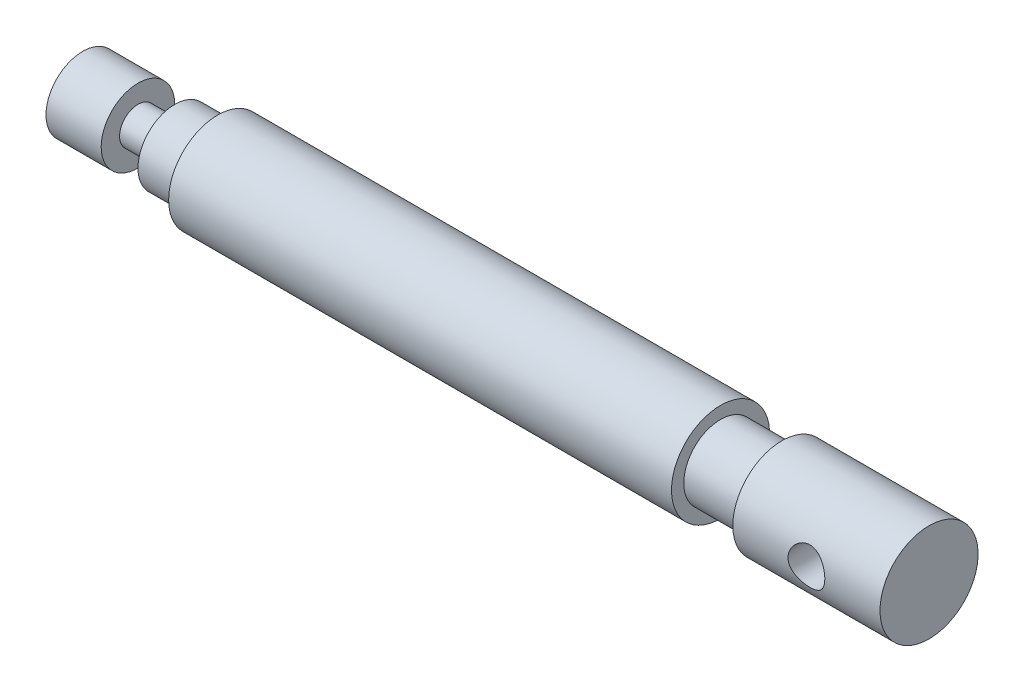
ISO-10303-21;
HEADER;
FILE_DESCRIPTION(('STEP AP214'),'2;1');
FILE_NAME('part.step','',(''),(''),'','','');
FILE_SCHEMA(('AUTOMOTIVE_DESIGN { 1 0 10303 214 1 1 1 1 }'));
ENDSEC;
DATA;
#1=APPLICATION_CONTEXT('core data for automotive mechanical design processes');
#2=APPLICATION_PROTOCOL_DEFINITION('international standard','automotive_design',2000,#1);
#3=PRODUCT_CONTEXT('',#1,'mechanical');
#4=PRODUCT('Part','Part','',(#3));
#5=PRODUCT_RELATED_PRODUCT_CATEGORY('part','',(#4));
#6=PRODUCT_DEFINITION_FORMATION('','',#4);
#7=PRODUCT_DEFINITION_CONTEXT('part definition',#1,'design');
#8=PRODUCT_DEFINITION('design','',#6,#7);
#9=PRODUCT_DEFINITION_SHAPE('','',#8);
#10=(LENGTH_UNIT() NAMED_UNIT(*) SI_UNIT(.MILLI.,.METRE.));
#11=(NAMED_UNIT(*) PLANE_ANGLE_UNIT() SI_UNIT($,.RADIAN.));
#12=(NAMED_UNIT(*) SI_UNIT($,.STERADIAN.) SOLID_ANGLE_UNIT());
#13=UNCERTAINTY_MEASURE_WITH_UNIT(LENGTH_MEASURE(1.E-05),#10,'distance_accuracy_value','');
#14=(GEOMETRIC_REPRESENTATION_CONTEXT(3) GLOBAL_UNCERTAINTY_ASSIGNED_CONTEXT((#13)) GLOBAL_UNIT_ASSIGNED_CONTEXT((#10,
#11,#12)) REPRESENTATION_CONTEXT('',''));
#15=CARTESIAN_POINT('',(0.,0.,0.));
#16=DIRECTION('',(0.,0.,1.));
#17=DIRECTION('',(1.,0.,0.));
#18=AXIS2_PLACEMENT_3D('',#15,#16,#17);
#19=CARTESIAN_POINT('',(0.,0.,0.));
#20=DIRECTION('',(1.,0.,0.));
#21=DIRECTION('',(0.,0.,-1.));
#22=AXIS2_PLACEMENT_3D('',#19,#20,#21);
#23=PLANE('',#22);
#24=CARTESIAN_POINT('',(0.,0.,0.));
#25=DIRECTION('',(-1.,0.,0.));
#26=DIRECTION('',(0.,0.,1.));
#27=AXIS2_PLACEMENT_3D('',#24,#25,#26);
#28=CIRCLE('',#27,6.);
#29=CARTESIAN_POINT('',(0.,0.,6.));
#30=VERTEX_POINT('',#29);
#31=EDGE_CURVE('E50',#30,#30,#28,.T.);
#32=ORIENTED_EDGE('',*,*,#31,.T.);
#33=EDGE_LOOP('',(#32));
#34=FACE_BOUND('',#33,.T.);
#35=ADVANCED_FACE('F35',(#34),#23,.F.);
#36=CARTESIAN_POINT('',(0.,0.,0.));
#37=DIRECTION('',(-1.,0.,0.));
#38=DIRECTION('',(0.,0.,1.));
#39=AXIS2_PLACEMENT_3D('',#36,#37,#38);
#40=CYLINDRICAL_SURFACE('',#39,6.);
#41=ORIENTED_EDGE('',*,*,#31,.F.);
#42=EDGE_LOOP('',(#41));
#43=FACE_BOUND('',#42,.T.);
#44=CARTESIAN_POINT('',(9.,0.,0.));
#45=DIRECTION('',(-1.,0.,0.));
#46=DIRECTION('',(0.,0.,1.));
#47=AXIS2_PLACEMENT_3D('',#44,#45,#46);
#48=CIRCLE('',#47,6.);
#49=CARTESIAN_POINT('',(9.,0.,6.));
#50=VERTEX_POINT('',#49);
#51=EDGE_CURVE('E54',#50,#50,#48,.T.);
#52=ORIENTED_EDGE('',*,*,#51,.T.);
#53=EDGE_LOOP('',(#52));
#54=FACE_BOUND('',#53,.T.);
#55=ADVANCED_FACE('F78',(#43,#54),#40,.T.);
#56=CARTESIAN_POINT('',(9.,6.,0.));
#57=DIRECTION('',(-1.,0.,0.));
#58=DIRECTION('',(0.,0.,1.));
#59=AXIS2_PLACEMENT_3D('',#56,#57,#58);
#60=PLANE('',#59);
#61=ORIENTED_EDGE('',*,*,#51,.F.);
#62=EDGE_LOOP('',(#61));
#63=FACE_BOUND('',#62,.T.);
#64=CARTESIAN_POINT('',(9.,0.,0.));
#65=DIRECTION('',(-1.,0.,0.));
#66=DIRECTION('',(0.,0.,1.));
#67=AXIS2_PLACEMENT_3D('',#64,#65,#66);
#68=CIRCLE('',#67,3.);
#69=CARTESIAN_POINT('',(9.,0.,3.));
#70=VERTEX_POINT('',#69);
#71=EDGE_CURVE('E90',#70,#70,#68,.T.);
#72=ORIENTED_EDGE('',*,*,#71,.T.);
#73=EDGE_LOOP('',(#72));
#74=FACE_BOUND('',#73,.T.);
#75=ADVANCED_FACE('F83',(#63,#74),#60,.F.);
#76=CARTESIAN_POINT('',(0.,0.,0.));
#77=DIRECTION('',(-1.,0.,0.));
#78=DIRECTION('',(0.,0.,1.));
#79=AXIS2_PLACEMENT_3D('',#76,#77,#78);
#80=CYLINDRICAL_SURFACE('',#79,3.);
#81=ORIENTED_EDGE('',*,*,#71,.F.);
#82=EDGE_LOOP('',(#81));
#83=FACE_BOUND('',#82,.T.);
#84=CARTESIAN_POINT('',(15.,0.,0.));
#85=DIRECTION('',(-1.,0.,0.));
#86=DIRECTION('',(0.,0.,1.));
#87=AXIS2_PLACEMENT_3D('',#84,#85,#86);
#88=CIRCLE('',#87,3.);
#89=CARTESIAN_POINT('',(15.,0.,3.));
#90=VERTEX_POINT('',#89);
#91=EDGE_CURVE('E92',#90,#90,#88,.T.);
#92=ORIENTED_EDGE('',*,*,#91,.T.);
#93=EDGE_LOOP('',(#92));
#94=FACE_BOUND('',#93,.T.);
#95=ADVANCED_FACE('F153',(#83,#94),#80,.T.);
#96=CARTESIAN_POINT('',(15.,3.,0.));
#97=DIRECTION('',(1.,0.,0.));
#98=DIRECTION('',(0.,0.,-1.));
#99=AXIS2_PLACEMENT_3D('',#96,#97,#98);
#100=PLANE('',#99);
#101=ORIENTED_EDGE('',*,*,#91,.F.);
#102=EDGE_LOOP('',(#101));
#103=FACE_BOUND('',#102,.T.);
#104=CARTESIAN_POINT('',(15.,0.,0.));
#105=DIRECTION('',(-1.,0.,0.));
#106=DIRECTION('',(0.,0.,1.));
#107=AXIS2_PLACEMENT_3D('',#104,#105,#106);
#108=CIRCLE('',#107,6.);
#109=CARTESIAN_POINT('',(15.,0.,6.));
#110=VERTEX_POINT('',#109);
#111=EDGE_CURVE('E97',#110,#110,#108,.T.);
#112=ORIENTED_EDGE('',*,*,#111,.T.);
#113=EDGE_LOOP('',(#112));
#114=FACE_BOUND('',#113,.T.);
#115=ADVANCED_FACE('F149',(#103,#114),#100,.F.);
#116=CARTESIAN_POINT('',(0.,0.,0.));
#117=DIRECTION('',(-1.,0.,0.));
#118=DIRECTION('',(0.,0.,1.));
#119=AXIS2_PLACEMENT_3D('',#116,#117,#118);
#120=CYLINDRICAL_SURFACE('',#119,6.);
#121=ORIENTED_EDGE('',*,*,#111,.F.);
#122=EDGE_LOOP('',(#121));
#123=FACE_BOUND('',#122,.T.);
#124=CARTESIAN_POINT('',(22.,0.,0.));
#125=DIRECTION('',(-1.,0.,0.));
#126=DIRECTION('',(0.,0.,1.));
#127=AXIS2_PLACEMENT_3D('',#124,#125,#126);
#128=CIRCLE('',#127,6.);
#129=CARTESIAN_POINT('',(22.,0.,6.));
#130=VERTEX_POINT('',#129);
#131=EDGE_CURVE('E100',#130,#130,#128,.T.);
#132=ORIENTED_EDGE('',*,*,#131,.T.);
#133=EDGE_LOOP('',(#132));
#134=FACE_BOUND('',#133,.T.);
#135=ADVANCED_FACE('F145',(#123,#134),#120,.T.);
#136=CARTESIAN_POINT('',(22.,6.,0.));
#137=DIRECTION('',(1.,0.,0.));
#138=DIRECTION('',(0.,0.,-1.));
#139=AXIS2_PLACEMENT_3D('',#136,#137,#138);
#140=PLANE('',#139);
#141=ORIENTED_EDGE('',*,*,#131,.F.);
#142=EDGE_LOOP('',(#141));
#143=FACE_BOUND('',#142,.T.);
#144=CARTESIAN_POINT('',(22.,0.,0.));
#145=DIRECTION('',(-1.,0.,0.));
#146=DIRECTION('',(0.,0.,1.));
#147=AXIS2_PLACEMENT_3D('',#144,#145,#146);
#148=CIRCLE('',#147,8.);
#149=CARTESIAN_POINT('',(22.,0.,8.));
#150=VERTEX_POINT('',#149);
#151=EDGE_CURVE('E103',#150,#150,#148,.T.);
#152=ORIENTED_EDGE('',*,*,#151,.T.);
#153=EDGE_LOOP('',(#152));
#154=FACE_BOUND('',#153,.T.);
#155=ADVANCED_FACE('F141',(#143,#154),#140,.F.);
#156=CARTESIAN_POINT('',(0.,0.,0.));
#157=DIRECTION('',(-1.,0.,0.));
#158=DIRECTION('',(0.,0.,1.));
#159=AXIS2_PLACEMENT_3D('',#156,#157,#158);
#160=CYLINDRICAL_SURFACE('',#159,8.);
#161=ORIENTED_EDGE('',*,*,#151,.F.);
#162=EDGE_LOOP('',(#161));
#163=FACE_BOUND('',#162,.T.);
#164=CARTESIAN_POINT('',(104.,0.,0.));
#165=DIRECTION('',(-1.,0.,0.));
#166=DIRECTION('',(0.,0.,1.));
#167=AXIS2_PLACEMENT_3D('',#164,#165,#166);
#168=CIRCLE('',#167,8.);
#169=CARTESIAN_POINT('',(104.,0.,8.));
#170=VERTEX_POINT('',#169);
#171=EDGE_CURVE('E106',#170,#170,#168,.T.);
#172=ORIENTED_EDGE('',*,*,#171,.T.);
#173=EDGE_LOOP('',(#172));
#174=FACE_BOUND('',#173,.T.);
#175=ADVANCED_FACE('F137',(#163,#174),#160,.T.);
#176=CARTESIAN_POINT('',(104.,8.,0.));
#177=DIRECTION('',(-1.,0.,0.));
#178=DIRECTION('',(0.,0.,1.));
#179=AXIS2_PLACEMENT_3D('',#176,#177,#178);
#180=PLANE('',#179);
#181=ORIENTED_EDGE('',*,*,#171,.F.);
#182=EDGE_LOOP('',(#181));
#183=FACE_BOUND('',#182,.T.);
#184=CARTESIAN_POINT('',(104.,0.,0.));
#185=DIRECTION('',(-1.,0.,0.));
#186=DIRECTION('',(0.,0.,1.));
#187=AXIS2_PLACEMENT_3D('',#184,#185,#186);
#188=CIRCLE('',#187,6.);
#189=CARTESIAN_POINT('',(104.,0.,6.));
#190=VERTEX_POINT('',#189);
#191=EDGE_CURVE('E109',#190,#190,#188,.T.);
#192=ORIENTED_EDGE('',*,*,#191,.T.);
#193=EDGE_LOOP('',(#192));
#194=FACE_BOUND('',#193,.T.);
#195=ADVANCED_FACE('F130',(#183,#194),#180,.F.);
#196=CARTESIAN_POINT('',(0.,0.,0.));
#197=DIRECTION('',(-1.,0.,0.));
#198=DIRECTION('',(0.,0.,1.));
#199=AXIS2_PLACEMENT_3D('',#196,#197,#198);
#200=CYLINDRICAL_SURFACE('',#199,6.);
#201=ORIENTED_EDGE('',*,*,#191,.F.);
#202=EDGE_LOOP('',(#201));
#203=FACE_BOUND('',#202,.T.);
#204=CARTESIAN_POINT('',(114.,0.,0.));
#205=DIRECTION('',(-1.,0.,0.));
#206=DIRECTION('',(0.,0.,1.));
#207=AXIS2_PLACEMENT_3D('',#204,#205,#206);
#208=CIRCLE('',#207,6.);
#209=CARTESIAN_POINT('',(114.,0.,6.));
#210=VERTEX_POINT('',#209);
#211=EDGE_CURVE('E112',#210,#210,#208,.T.);
#212=ORIENTED_EDGE('',*,*,#211,.T.);
#213=EDGE_LOOP('',(#212));
#214=FACE_BOUND('',#213,.T.);
#215=ADVANCED_FACE('F125',(#203,#214),#200,.T.);
#216=CARTESIAN_POINT('',(114.,6.,0.));
#217=DIRECTION('',(1.,0.,0.));
#218=DIRECTION('',(0.,0.,-1.));
#219=AXIS2_PLACEMENT_3D('',#216,#217,#218);
#220=PLANE('',#219);
#221=ORIENTED_EDGE('',*,*,#211,.F.);
#222=EDGE_LOOP('',(#221));
#223=FACE_BOUND('',#222,.T.);
#224=CARTESIAN_POINT('',(114.,0.,0.));
#225=DIRECTION('',(-1.,0.,0.));
#226=DIRECTION('',(0.,0.,1.));
#227=AXIS2_PLACEMENT_3D('',#224,#225,#226);
#228=CIRCLE('',#227,8.);
#229=CARTESIAN_POINT('',(114.,0.,8.));
#230=VERTEX_POINT('',#229);
#231=EDGE_CURVE('E115',#230,#230,#228,.T.);
#232=ORIENTED_EDGE('',*,*,#231,.T.);
#233=EDGE_LOOP('',(#232));
#234=FACE_BOUND('',#233,.T.);
#235=ADVANCED_FACE('F75',(#223,#234),#220,.F.);
#236=CARTESIAN_POINT('',(0.,0.,0.));
#237=DIRECTION('',(-1.,0.,0.));
#238=DIRECTION('',(0.,0.,1.));
#239=AXIS2_PLACEMENT_3D('',#236,#237,#238);
#240=CYLINDRICAL_SURFACE('',#239,8.);
#241=CARTESIAN_POINT('',(129.,0.,-8.));
#242=CARTESIAN_POINT('',(129.000005804606,0.162470117875706,-8.00000434912302));
#243=CARTESIAN_POINT('',(128.986760479503,0.324900483563585,-7.99500758566368));
#244=CARTESIAN_POINT('',(128.93434360946,0.644906904704722,-7.97557392013855));
#245=CARTESIAN_POINT('',(128.895175799059,0.80248365597523,-7.96113837787987));
#246=CARTESIAN_POINT('',(128.792493996456,1.10812156998176,-7.92437664783088));
#247=CARTESIAN_POINT('',(128.729026966356,1.25620044832457,-7.90206568698877));
#248=CARTESIAN_POINT('',(128.579787173968,1.53959862032052,-7.85177535530709));
#249=CARTESIAN_POINT('',(128.494008428912,1.67491447835577,-7.82379446455106));
#250=CARTESIAN_POINT('',(128.298774937858,1.93469283409165,-7.76372493942421));
#251=CARTESIAN_POINT('',(128.188539475481,2.05854146030238,-7.73152005167087));
#252=CARTESIAN_POINT('',(127.949179130682,2.28648842948729,-7.66720441742698));
#253=CARTESIAN_POINT('',(127.820048487824,2.39058072718412,-7.63509370270232));
#254=CARTESIAN_POINT('',(127.540565064953,2.57996404431964,-7.5732494123529));
#255=CARTESIAN_POINT('',(127.389591266908,2.66438786391496,-7.5436529764098));
#256=CARTESIAN_POINT('',(127.074303291663,2.80637292668193,-7.49199720475523));
#257=CARTESIAN_POINT('',(126.909994473691,2.86394489922567,-7.46993485954215));
#258=CARTESIAN_POINT('',(126.579766519482,2.94816862035012,-7.4370882564592));
#259=CARTESIAN_POINT('',(126.414189923123,2.97599186436802,-7.42587848693064));
#260=CARTESIAN_POINT('',(126.080367684018,3.00359113063608,-7.41476122931038));
#261=CARTESIAN_POINT('',(125.912123172274,3.00337873606424,-7.41484907350686));
#262=CARTESIAN_POINT('',(125.588460949543,2.97580859218857,-7.42595023233986));
#263=CARTESIAN_POINT('',(125.432878187815,2.9500761701371,-7.43630937632965));
#264=CARTESIAN_POINT('',(125.128425699098,2.87488335732474,-7.46569876010067));
#265=CARTESIAN_POINT('',(124.979556986751,2.82541939325576,-7.48473030568195));
#266=CARTESIAN_POINT('',(124.689445864573,2.70327497145115,-7.52971404410467));
#267=CARTESIAN_POINT('',(124.548401027765,2.63017297474552,-7.55579035984378));
#268=CARTESIAN_POINT('',(124.28010852481,2.46312147525044,-7.61188420270589));
#269=CARTESIAN_POINT('',(124.152865644958,2.36916477457696,-7.64190308912094));
#270=CARTESIAN_POINT('',(123.906792672701,2.155635615332,-7.70496077720597));
#271=CARTESIAN_POINT('',(123.789102718504,2.03476597433937,-7.73806694911977));
#272=CARTESIAN_POINT('',(123.575324067588,1.77462518163774,-7.80183456327536));
#273=CARTESIAN_POINT('',(123.479238690788,1.63535120699463,-7.83249562931733));
#274=CARTESIAN_POINT('',(123.310139205875,1.3394468739849,-7.88852789618334));
#275=CARTESIAN_POINT('',(123.237504837558,1.18258142768944,-7.91380996519279));
#276=CARTESIAN_POINT('',(123.12003479146,0.857673701049136,-7.95557436653878));
#277=CARTESIAN_POINT('',(123.075186766878,0.689636421691522,-7.97206060682974));
#278=CARTESIAN_POINT('',(123.016754424916,0.35675048629733,-7.99368886456142));
#279=CARTESIAN_POINT('',(123.001634787235,0.192207239124415,-7.99938738051376));
#280=CARTESIAN_POINT('',(122.9986178722,-0.137144950510055,-8.00051787400248));
#281=CARTESIAN_POINT('',(123.010714559366,-0.301953825966751,-7.99595212773726));
#282=CARTESIAN_POINT('',(123.060620084617,-0.620524097123724,-7.97743419545287));
#283=CARTESIAN_POINT('',(123.097423087474,-0.774466656014678,-7.9638494192461));
#284=CARTESIAN_POINT('',(123.194372145095,-1.07388350991445,-7.92902954183434));
#285=CARTESIAN_POINT('',(123.254521235896,-1.21935670069507,-7.9077934456406));
#286=CARTESIAN_POINT('',(123.398372824879,-1.50249553022031,-7.85899248815363));
#287=CARTESIAN_POINT('',(123.482715458447,-1.63980616711559,-7.83126000418696));
#288=CARTESIAN_POINT('',(123.671836206343,-1.89878542345325,-7.77253343129328));
#289=CARTESIAN_POINT('',(123.77662186509,-2.0204482405409,-7.74153814019032));
#290=CARTESIAN_POINT('',(124.010808244249,-2.25206159748908,-7.67746658981979));
#291=CARTESIAN_POINT('',(124.141284365545,-2.36092308247137,-7.64437393007459));
#292=CARTESIAN_POINT('',(124.419302769415,-2.55542100063806,-7.58157631493707));
#293=CARTESIAN_POINT('',(124.566846582777,-2.64105534829036,-7.55187166388799));
#294=CARTESIAN_POINT('',(124.876031973545,-2.78675547037995,-7.49933659644927));
#295=CARTESIAN_POINT('',(125.037729491821,-2.84671370893836,-7.47653520656987));
#296=CARTESIAN_POINT('',(125.370019527376,-2.93815766933778,-7.4410806578201));
#297=CARTESIAN_POINT('',(125.540606472396,-2.9696610061107,-7.42842122114981));
#298=CARTESIAN_POINT('',(125.874032319082,-3.00172694195678,-7.41551789585147));
#299=CARTESIAN_POINT('',(126.036665263434,-3.00414662991674,-7.41452889046682));
#300=CARTESIAN_POINT('',(126.359890632552,-2.98273431283185,-7.42316825490584));
#301=CARTESIAN_POINT('',(126.520483249343,-2.95890479700246,-7.43279561797798));
#302=CARTESIAN_POINT('',(126.830094453433,-2.88711631260482,-7.46096283170865));
#303=CARTESIAN_POINT('',(126.979316692491,-2.83991596633047,-7.47922170753326));
#304=CARTESIAN_POINT('',(127.267811016989,-2.72339393559838,-7.5224309659569));
#305=CARTESIAN_POINT('',(127.40708057614,-2.65406665889889,-7.54738303990429));
#306=CARTESIAN_POINT('',(127.679653579395,-2.49104151876307,-7.60279447807929));
#307=CARTESIAN_POINT('',(127.8122615936,-2.39625665606019,-7.63347396881929));
#308=CARTESIAN_POINT('',(128.060283121942,-2.18668971459811,-7.69612493514355));
#309=CARTESIAN_POINT('',(128.175691149574,-2.07190128025615,-7.7280968188629));
#310=CARTESIAN_POINT('',(128.392403911644,-1.81816079356923,-7.79180849219762));
#311=CARTESIAN_POINT('',(128.492607506869,-1.67823728842597,-7.82344209801289));
#312=CARTESIAN_POINT('',(128.668045310553,-1.38242644640163,-7.88109028914061));
#313=CARTESIAN_POINT('',(128.743277575473,-1.22653786818123,-7.90710443703119));
#314=CARTESIAN_POINT('',(128.868753658097,-0.895998164004614,-7.9514858521336));
#315=CARTESIAN_POINT('',(128.917774129204,-0.720826844468407,-7.96947314316712));
#316=CARTESIAN_POINT('',(128.983385919841,-0.363751467212758,-7.99372484359173));
#317=CARTESIAN_POINT('',(128.999993502975,-0.181850832729716,-7.99999513207934));
#318=CARTESIAN_POINT('',(129.,0.,-8.));
#319=B_SPLINE_CURVE_WITH_KNOTS('',3,(#241,#242,#243,#244,#245,#246,#247,#248,#249,#250,#251,
#252,#253,#254,#255,#256,#257,#258,#259,#260,#261,#262,#263,#264,#265,#266,#267,#268,#269,#270,
#271,#272,#273,#274,#275,#276,#277,#278,#279,#280,#281,#282,#283,#284,#285,#286,#287,#288,#289,
#290,#291,#292,#293,#294,#295,#296,#297,#298,#299,#300,#301,#302,#303,#304,#305,#306,#307,#308,
#309,#310,#311,#312,#313,#314,#315,#316,#317,#318),.UNSPECIFIED.,.T.,.F.,(4,2,2,2,2,2,2,2,2,2,2,
2,2,2,2,2,2,2,2,2,2,2,2,2,2,2,2,2,2,2,2,2,2,2,2,2,2,2,4),(0.,0.48673960312112,0.973409099060925,
1.45914273842716,1.94500675921899,2.44947237165432,2.95409209851245,3.47793349003318,
4.00156538704269,4.503717488338,5.00566212159414,5.47756690242935,5.9495427612685,
6.43044816779709,6.9115198149419,7.424923066773,7.93840515815806,8.45982750577824,
8.98101799403364,9.47450039277523,9.96787336786714,10.4422887585335,10.9167658651458,
11.4051844372487,11.8937836004541,12.4107303891699,12.9277235784595,13.4468613346008,
13.9656774991869,14.4511752696618,14.9366270042819,15.4072628485874,15.8780177331869,
16.3734494377421,16.869038839998,17.3914465931375,17.9138949961588,18.4589703006976,
19.0037720359793),.UNSPECIFIED.);
#320=CARTESIAN_POINT('',(129.,0.,-8.));
#321=VERTEX_POINT('',#320);
#322=EDGE_CURVE('E10',#321,#321,#319,.T.);
#323=ORIENTED_EDGE('',*,*,#322,.T.);
#324=EDGE_LOOP('',(#323));
#325=FACE_BOUND('',#324,.T.);
#326=CARTESIAN_POINT('',(129.,0.,8.));
#327=CARTESIAN_POINT('',(129.000005804606,-0.162470117875706,8.00000434912302));
#328=CARTESIAN_POINT('',(128.986760479503,-0.324900483563585,7.99500758566368));
#329=CARTESIAN_POINT('',(128.93434360946,-0.644906904704722,7.97557392013855));
#330=CARTESIAN_POINT('',(128.895175799059,-0.80248365597523,7.96113837787987));
#331=CARTESIAN_POINT('',(128.792493996456,-1.10812156998176,7.92437664783088));
#332=CARTESIAN_POINT('',(128.729026966356,-1.25620044832457,7.90206568698877));
#333=CARTESIAN_POINT('',(128.579787173968,-1.53959862032052,7.85177535530709));
#334=CARTESIAN_POINT('',(128.494008428912,-1.67491447835577,7.82379446455106));
#335=CARTESIAN_POINT('',(128.298774937858,-1.93469283409165,7.76372493942421));
#336=CARTESIAN_POINT('',(128.188539475481,-2.05854146030238,7.73152005167087));
#337=CARTESIAN_POINT('',(127.949179130682,-2.28648842948729,7.66720441742698));
#338=CARTESIAN_POINT('',(127.820048487824,-2.39058072718412,7.63509370270232));
#339=CARTESIAN_POINT('',(127.540565064953,-2.57996404431964,7.5732494123529));
#340=CARTESIAN_POINT('',(127.389591266908,-2.66438786391496,7.5436529764098));
#341=CARTESIAN_POINT('',(127.074303291663,-2.80637292668193,7.49199720475523));
#342=CARTESIAN_POINT('',(126.909994473691,-2.86394489922567,7.46993485954215));
#343=CARTESIAN_POINT('',(126.579766519482,-2.94816862035012,7.4370882564592));
#344=CARTESIAN_POINT('',(126.414189923123,-2.97599186436802,7.42587848693064));
#345=CARTESIAN_POINT('',(126.080367684018,-3.00359113063608,7.41476122931038));
#346=CARTESIAN_POINT('',(125.912123172274,-3.00337873606424,7.41484907350686));
#347=CARTESIAN_POINT('',(125.588460949543,-2.97580859218857,7.42595023233986));
#348=CARTESIAN_POINT('',(125.432878187815,-2.9500761701371,7.43630937632965));
#349=CARTESIAN_POINT('',(125.128425699098,-2.87488335732474,7.46569876010067));
#350=CARTESIAN_POINT('',(124.979556986751,-2.82541939325576,7.48473030568195));
#351=CARTESIAN_POINT('',(124.689445864573,-2.70327497145115,7.52971404410467));
#352=CARTESIAN_POINT('',(124.548401027765,-2.63017297474552,7.55579035984378));
#353=CARTESIAN_POINT('',(124.28010852481,-2.46312147525044,7.61188420270589));
#354=CARTESIAN_POINT('',(124.152865644958,-2.36916477457696,7.64190308912094));
#355=CARTESIAN_POINT('',(123.906792672701,-2.155635615332,7.70496077720597));
#356=CARTESIAN_POINT('',(123.789102718504,-2.03476597433937,7.73806694911977));
#357=CARTESIAN_POINT('',(123.575324067588,-1.77462518163774,7.80183456327536));
#358=CARTESIAN_POINT('',(123.479238690788,-1.63535120699463,7.83249562931733));
#359=CARTESIAN_POINT('',(123.310139205875,-1.3394468739849,7.88852789618334));
#360=CARTESIAN_POINT('',(123.237504837558,-1.18258142768944,7.91380996519279));
#361=CARTESIAN_POINT('',(123.12003479146,-0.857673701049136,7.95557436653878));
#362=CARTESIAN_POINT('',(123.075186766878,-0.689636421691522,7.97206060682974));
#363=CARTESIAN_POINT('',(123.016754424916,-0.35675048629733,7.99368886456142));
#364=CARTESIAN_POINT('',(123.001634787235,-0.192207239124415,7.99938738051376));
#365=CARTESIAN_POINT('',(122.9986178722,0.137144950510055,8.00051787400248));
#366=CARTESIAN_POINT('',(123.010714559366,0.301953825966751,7.99595212773726));
#367=CARTESIAN_POINT('',(123.060620084617,0.620524097123724,7.97743419545287));
#368=CARTESIAN_POINT('',(123.097423087474,0.774466656014678,7.9638494192461));
#369=CARTESIAN_POINT('',(123.194372145095,1.07388350991445,7.92902954183434));
#370=CARTESIAN_POINT('',(123.254521235896,1.21935670069507,7.9077934456406));
#371=CARTESIAN_POINT('',(123.398372824879,1.50249553022031,7.85899248815363));
#372=CARTESIAN_POINT('',(123.482715458447,1.63980616711559,7.83126000418696));
#373=CARTESIAN_POINT('',(123.671836206343,1.89878542345325,7.77253343129328));
#374=CARTESIAN_POINT('',(123.77662186509,2.0204482405409,7.74153814019032));
#375=CARTESIAN_POINT('',(124.010808244249,2.25206159748908,7.67746658981979));
#376=CARTESIAN_POINT('',(124.141284365545,2.36092308247137,7.64437393007459));
#377=CARTESIAN_POINT('',(124.419302769415,2.55542100063806,7.58157631493707));
#378=CARTESIAN_POINT('',(124.566846582777,2.64105534829036,7.55187166388799));
#379=CARTESIAN_POINT('',(124.876031973545,2.78675547037995,7.49933659644927));
#380=CARTESIAN_POINT('',(125.037729491821,2.84671370893836,7.47653520656987));
#381=CARTESIAN_POINT('',(125.370019527376,2.93815766933778,7.4410806578201));
#382=CARTESIAN_POINT('',(125.540606472396,2.9696610061107,7.42842122114981));
#383=CARTESIAN_POINT('',(125.874032319082,3.00172694195678,7.41551789585147));
#384=CARTESIAN_POINT('',(126.036665263434,3.00414662991674,7.41452889046682));
#385=CARTESIAN_POINT('',(126.359890632552,2.98273431283185,7.42316825490584));
#386=CARTESIAN_POINT('',(126.520483249343,2.95890479700246,7.43279561797798));
#387=CARTESIAN_POINT('',(126.830094453433,2.88711631260482,7.46096283170865));
#388=CARTESIAN_POINT('',(126.979316692491,2.83991596633047,7.47922170753326));
#389=CARTESIAN_POINT('',(127.267811016989,2.72339393559838,7.5224309659569));
#390=CARTESIAN_POINT('',(127.40708057614,2.65406665889889,7.54738303990429));
#391=CARTESIAN_POINT('',(127.679653579395,2.49104151876307,7.60279447807929));
#392=CARTESIAN_POINT('',(127.8122615936,2.39625665606019,7.63347396881929));
#393=CARTESIAN_POINT('',(128.060283121942,2.18668971459811,7.69612493514355));
#394=CARTESIAN_POINT('',(128.175691149574,2.07190128025615,7.7280968188629));
#395=CARTESIAN_POINT('',(128.392403911644,1.81816079356923,7.79180849219762));
#396=CARTESIAN_POINT('',(128.492607506869,1.67823728842597,7.82344209801289));
#397=CARTESIAN_POINT('',(128.668045310553,1.38242644640163,7.88109028914061));
#398=CARTESIAN_POINT('',(128.743277575473,1.22653786818123,7.90710443703119));
#399=CARTESIAN_POINT('',(128.868753658097,0.895998164004614,7.9514858521336));
#400=CARTESIAN_POINT('',(128.917774129204,0.720826844468407,7.96947314316712));
#401=CARTESIAN_POINT('',(128.983385919841,0.363751467212758,7.99372484359173));
#402=CARTESIAN_POINT('',(128.999993502975,0.181850832729716,7.99999513207934));
#403=CARTESIAN_POINT('',(129.,0.,8.));
#404=B_SPLINE_CURVE_WITH_KNOTS('',3,(#326,#327,#328,#329,#330,#331,#332,#333,#334,#335,#336,
#337,#338,#339,#340,#341,#342,#343,#344,#345,#346,#347,#348,#349,#350,#351,#352,#353,#354,#355,
#356,#357,#358,#359,#360,#361,#362,#363,#364,#365,#366,#367,#368,#369,#370,#371,#372,#373,#374,
#375,#376,#377,#378,#379,#380,#381,#382,#383,#384,#385,#386,#387,#388,#389,#390,#391,#392,#393,
#394,#395,#396,#397,#398,#399,#400,#401,#402,#403),.UNSPECIFIED.,.T.,.F.,(4,2,2,2,2,2,2,2,2,2,2,
2,2,2,2,2,2,2,2,2,2,2,2,2,2,2,2,2,2,2,2,2,2,2,2,2,2,2,4),(0.,0.48673960312112,0.973409099060925,
1.45914273842716,1.94500675921899,2.44947237165432,2.95409209851245,3.47793349003318,
4.00156538704269,4.503717488338,5.00566212159414,5.47756690242935,5.9495427612685,
6.43044816779709,6.9115198149419,7.424923066773,7.93840515815806,8.45982750577824,
8.98101799403364,9.47450039277523,9.96787336786714,10.4422887585335,10.9167658651458,
11.4051844372487,11.8937836004541,12.4107303891699,12.9277235784595,13.4468613346008,
13.9656774991869,14.4511752696618,14.9366270042819,15.4072628485874,15.8780177331869,
16.3734494377421,16.869038839998,17.3914465931375,17.9138949961588,18.4589703006976,
19.0037720359793),.UNSPECIFIED.);
#405=CARTESIAN_POINT('',(129.,0.,8.));
#406=VERTEX_POINT('',#405);
#407=EDGE_CURVE('E46',#406,#406,#404,.T.);
#408=ORIENTED_EDGE('',*,*,#407,.T.);
#409=EDGE_LOOP('',(#408));
#410=FACE_BOUND('',#409,.T.);
#411=ORIENTED_EDGE('',*,*,#231,.F.);
#412=EDGE_LOOP('',(#411));
#413=FACE_BOUND('',#412,.T.);
#414=CARTESIAN_POINT('',(138.,0.,0.));
#415=DIRECTION('',(-1.,0.,0.));
#416=DIRECTION('',(0.,0.,1.));
#417=AXIS2_PLACEMENT_3D('',#414,#415,#416);
#418=CIRCLE('',#417,8.);
#419=CARTESIAN_POINT('',(138.,0.,8.));
#420=VERTEX_POINT('',#419);
#421=EDGE_CURVE('E118',#420,#420,#418,.T.);
#422=ORIENTED_EDGE('',*,*,#421,.T.);
#423=EDGE_LOOP('',(#422));
#424=FACE_BOUND('',#423,.T.);
#425=ADVANCED_FACE('F60',(#325,#410,#413,#424),#240,.T.);
#426=CARTESIAN_POINT('',(138.,8.,0.));
#427=DIRECTION('',(-1.,0.,0.));
#428=DIRECTION('',(0.,0.,1.));
#429=AXIS2_PLACEMENT_3D('',#426,#427,#428);
#430=PLANE('',#429);
#431=ORIENTED_EDGE('',*,*,#421,.F.);
#432=EDGE_LOOP('',(#431));
#433=FACE_BOUND('',#432,.T.);
#434=ADVANCED_FACE('F67',(#433),#430,.F.);
#435=CARTESIAN_POINT('',(126.,0.,-8.));
#436=DIRECTION('',(0.,0.,1.));
#437=DIRECTION('',(1.,0.,0.));
#438=AXIS2_PLACEMENT_3D('',#435,#436,#437);
#439=CYLINDRICAL_SURFACE('',#438,2.99999999999999);
#440=ORIENTED_EDGE('',*,*,#407,.F.);
#441=EDGE_LOOP('',(#440));
#442=FACE_BOUND('',#441,.T.);
#443=ORIENTED_EDGE('',*,*,#322,.F.);
#444=EDGE_LOOP('',(#443));
#445=FACE_BOUND('',#444,.T.);
#446=ADVANCED_FACE('F64',(#442,#445),#439,.F.);
#447=CLOSED_SHELL('',(#35,#55,#75,#95,#115,#135,#155,#175,#195,#215,#235,#425,#434,#446));
#448=MANIFOLD_SOLID_BREP('B2',#447);
#449=ADVANCED_BREP_SHAPE_REPRESENTATION('',(#18,#448),#14);
#450=SHAPE_DEFINITION_REPRESENTATION(#9,#449);
ENDSEC;
END-ISO-10303-21;
